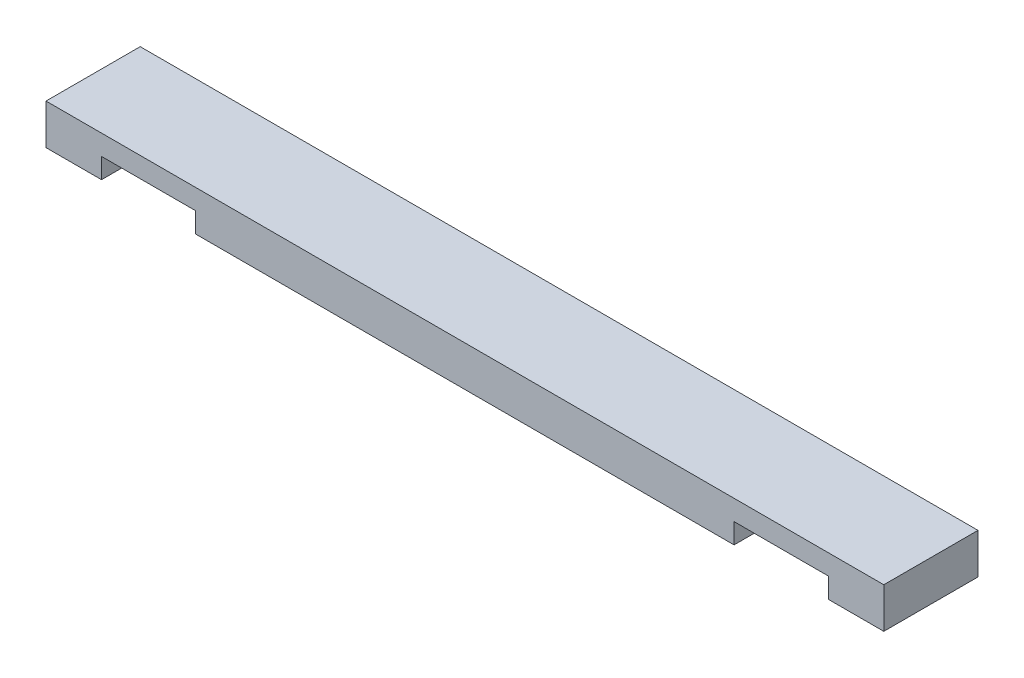
ISO-10303-21;
HEADER;
FILE_DESCRIPTION(('STEP AP214'),'2;1');
FILE_NAME('part.step','',(''),(''),'','','');
FILE_SCHEMA(('AUTOMOTIVE_DESIGN { 1 0 10303 214 1 1 1 1 }'));
ENDSEC;
DATA;
#1=APPLICATION_CONTEXT('core data for automotive mechanical design processes');
#2=APPLICATION_PROTOCOL_DEFINITION('international standard','automotive_design',2000,#1);
#3=PRODUCT_CONTEXT('',#1,'mechanical');
#4=PRODUCT('Part','Part','',(#3));
#5=PRODUCT_RELATED_PRODUCT_CATEGORY('part','',(#4));
#6=PRODUCT_DEFINITION_FORMATION('','',#4);
#7=PRODUCT_DEFINITION_CONTEXT('part definition',#1,'design');
#8=PRODUCT_DEFINITION('design','',#6,#7);
#9=PRODUCT_DEFINITION_SHAPE('','',#8);
#10=(LENGTH_UNIT() NAMED_UNIT(*) SI_UNIT(.MILLI.,.METRE.));
#11=(NAMED_UNIT(*) PLANE_ANGLE_UNIT() SI_UNIT($,.RADIAN.));
#12=(NAMED_UNIT(*) SI_UNIT($,.STERADIAN.) SOLID_ANGLE_UNIT());
#13=UNCERTAINTY_MEASURE_WITH_UNIT(LENGTH_MEASURE(1.E-05),#10,'distance_accuracy_value','');
#14=(GEOMETRIC_REPRESENTATION_CONTEXT(3) GLOBAL_UNCERTAINTY_ASSIGNED_CONTEXT((#13)) GLOBAL_UNIT_ASSIGNED_CONTEXT((#10,
#11,#12)) REPRESENTATION_CONTEXT('',''));
#15=CARTESIAN_POINT('',(0.,0.,0.));
#16=DIRECTION('',(0.,0.,1.));
#17=DIRECTION('',(1.,0.,0.));
#18=AXIS2_PLACEMENT_3D('',#15,#16,#17);
#19=CARTESIAN_POINT('',(0.,0.,0.));
#20=DIRECTION('',(0.,-1.,0.));
#21=DIRECTION('',(0.,0.,-1.));
#22=AXIS2_PLACEMENT_3D('',#19,#20,#21);
#23=PLANE('',#22);
#24=DIRECTION('',(0.,0.,1.));
#25=VECTOR('',#24,1.);
#26=CARTESIAN_POINT('',(738.187500000009,0.,-88.9));
#27=LINE('',#26,#25);
#28=CARTESIAN_POINT('',(738.187500000009,0.,-88.9));
#29=VERTEX_POINT('',#28);
#30=CARTESIAN_POINT('',(738.187500000009,0.,0.));
#31=VERTEX_POINT('',#30);
#32=EDGE_CURVE('E172',#29,#31,#27,.T.);
#33=ORIENTED_EDGE('',*,*,#32,.F.);
#34=DIRECTION('',(-1.,0.,0.));
#35=VECTOR('',#34,1.);
#36=CARTESIAN_POINT('',(0.,0.,-88.9));
#37=LINE('',#36,#35);
#38=CARTESIAN_POINT('',(790.575,0.,-88.9));
#39=VERTEX_POINT('',#38);
#40=EDGE_CURVE('E157',#39,#29,#37,.T.);
#41=ORIENTED_EDGE('',*,*,#40,.F.);
#42=DIRECTION('',(0.,0.,-1.));
#43=VECTOR('',#42,1.);
#44=CARTESIAN_POINT('',(790.575,0.,0.));
#45=LINE('',#44,#43);
#46=CARTESIAN_POINT('',(790.575,0.,0.));
#47=VERTEX_POINT('',#46);
#48=EDGE_CURVE('E236',#47,#39,#45,.T.);
#49=ORIENTED_EDGE('',*,*,#48,.F.);
#50=DIRECTION('',(1.,0.,0.));
#51=VECTOR('',#50,1.);
#52=CARTESIAN_POINT('',(0.,0.,0.));
#53=LINE('',#52,#51);
#54=EDGE_CURVE('E231',#31,#47,#53,.T.);
#55=ORIENTED_EDGE('',*,*,#54,.F.);
#56=EDGE_LOOP('',(#33,#41,#49,#55));
#57=FACE_BOUND('',#56,.T.);
#58=ADVANCED_FACE('F41',(#57),#23,.T.);
#59=DIRECTION('',(0.,0.,1.));
#60=VECTOR('',#59,1.);
#61=CARTESIAN_POINT('',(649.287500000009,0.,-88.9));
#62=LINE('',#61,#60);
#63=CARTESIAN_POINT('',(649.287500000009,0.,-88.9));
#64=VERTEX_POINT('',#63);
#65=CARTESIAN_POINT('',(649.287500000008,0.,0.));
#66=VERTEX_POINT('',#65);
#67=EDGE_CURVE('E176',#64,#66,#62,.T.);
#68=ORIENTED_EDGE('',*,*,#67,.T.);
#69=CARTESIAN_POINT('',(141.300199999996,0.,0.));
#70=VERTEX_POINT('',#69);
#71=EDGE_CURVE('E237',#70,#66,#53,.T.);
#72=ORIENTED_EDGE('',*,*,#71,.F.);
#73=DIRECTION('',(0.,0.,1.));
#74=VECTOR('',#73,1.);
#75=CARTESIAN_POINT('',(141.300199999996,0.,-88.9));
#76=LINE('',#75,#74);
#77=CARTESIAN_POINT('',(141.300199999996,0.,-88.9));
#78=VERTEX_POINT('',#77);
#79=EDGE_CURVE('E191',#78,#70,#76,.T.);
#80=ORIENTED_EDGE('',*,*,#79,.F.);
#81=EDGE_CURVE('E243',#64,#78,#37,.T.);
#82=ORIENTED_EDGE('',*,*,#81,.F.);
#83=EDGE_LOOP('',(#68,#72,#80,#82));
#84=FACE_BOUND('',#83,.T.);
#85=ADVANCED_FACE('F294',(#84),#23,.T.);
#86=CARTESIAN_POINT('',(0.,38.1,0.));
#87=DIRECTION('',(1.,0.,0.));
#88=DIRECTION('',(0.,0.,-1.));
#89=AXIS2_PLACEMENT_3D('',#86,#87,#88);
#90=PLANE('',#89);
#91=DIRECTION('',(0.,0.,1.));
#92=VECTOR('',#91,1.);
#93=CARTESIAN_POINT('',(0.,0.,0.));
#94=LINE('',#93,#92);
#95=CARTESIAN_POINT('',(0.,0.,-88.9));
#96=VERTEX_POINT('',#95);
#97=CARTESIAN_POINT('',(0.,0.,0.));
#98=VERTEX_POINT('',#97);
#99=EDGE_CURVE('E175',#96,#98,#94,.T.);
#100=ORIENTED_EDGE('',*,*,#99,.T.);
#101=DIRECTION('',(0.,-1.,0.));
#102=VECTOR('',#101,1.);
#103=CARTESIAN_POINT('',(0.,38.1,0.));
#104=LINE('',#103,#102);
#105=CARTESIAN_POINT('',(0.,38.1,0.));
#106=VERTEX_POINT('',#105);
#107=EDGE_CURVE('E11',#106,#98,#104,.T.);
#108=ORIENTED_EDGE('',*,*,#107,.F.);
#109=DIRECTION('',(0.,0.,1.));
#110=VECTOR('',#109,1.);
#111=CARTESIAN_POINT('',(0.,38.1,0.));
#112=LINE('',#111,#110);
#113=CARTESIAN_POINT('',(0.,38.1,-88.9));
#114=VERTEX_POINT('',#113);
#115=EDGE_CURVE('E214',#114,#106,#112,.T.);
#116=ORIENTED_EDGE('',*,*,#115,.F.);
#117=DIRECTION('',(0.,-1.,0.));
#118=VECTOR('',#117,1.);
#119=CARTESIAN_POINT('',(0.,38.1,-88.9));
#120=LINE('',#119,#118);
#121=EDGE_CURVE('E227',#114,#96,#120,.T.);
#122=ORIENTED_EDGE('',*,*,#121,.T.);
#123=EDGE_LOOP('',(#100,#108,#116,#122));
#124=FACE_BOUND('',#123,.T.);
#125=ADVANCED_FACE('F43',(#124),#90,.F.);
#126=CARTESIAN_POINT('',(0.,38.1,0.));
#127=DIRECTION('',(0.,0.,-1.));
#128=DIRECTION('',(-1.,0.,0.));
#129=AXIS2_PLACEMENT_3D('',#126,#127,#128);
#130=PLANE('',#129);
#131=DIRECTION('',(-1.,0.,0.));
#132=VECTOR('',#131,1.);
#133=CARTESIAN_POINT('',(738.187500000009,19.05,0.));
#134=LINE('',#133,#132);
#135=CARTESIAN_POINT('',(738.187500000009,19.05,0.));
#136=VERTEX_POINT('',#135);
#137=CARTESIAN_POINT('',(649.287500000009,19.05,0.));
#138=VERTEX_POINT('',#137);
#139=EDGE_CURVE('E162',#136,#138,#134,.T.);
#140=ORIENTED_EDGE('',*,*,#139,.F.);
#141=DIRECTION('',(0.,1.,0.));
#142=VECTOR('',#141,1.);
#143=CARTESIAN_POINT('',(738.187500000009,0.,0.));
#144=LINE('',#143,#142);
#145=EDGE_CURVE('E137',#31,#136,#144,.T.);
#146=ORIENTED_EDGE('',*,*,#145,.F.);
#147=ORIENTED_EDGE('',*,*,#54,.T.);
#148=DIRECTION('',(0.,-1.,0.));
#149=VECTOR('',#148,1.);
#150=CARTESIAN_POINT('',(790.575,38.1,0.));
#151=LINE('',#150,#149);
#152=CARTESIAN_POINT('',(790.575,38.1,0.));
#153=VERTEX_POINT('',#152);
#154=EDGE_CURVE('E50',#153,#47,#151,.T.);
#155=ORIENTED_EDGE('',*,*,#154,.F.);
#156=DIRECTION('',(1.,0.,0.));
#157=VECTOR('',#156,1.);
#158=CARTESIAN_POINT('',(0.,38.1,0.));
#159=LINE('',#158,#157);
#160=EDGE_CURVE('E218',#106,#153,#159,.T.);
#161=ORIENTED_EDGE('',*,*,#160,.F.);
#162=ORIENTED_EDGE('',*,*,#107,.T.);
#163=CARTESIAN_POINT('',(52.400199999996,0.,0.));
#164=VERTEX_POINT('',#163);
#165=EDGE_CURVE('E232',#98,#164,#53,.T.);
#166=ORIENTED_EDGE('',*,*,#165,.T.);
#167=DIRECTION('',(0.,-1.,0.));
#168=VECTOR('',#167,1.);
#169=CARTESIAN_POINT('',(52.400199999996,0.,0.));
#170=LINE('',#169,#168);
#171=CARTESIAN_POINT('',(52.400199999996,19.05,0.));
#172=VERTEX_POINT('',#171);
#173=EDGE_CURVE('E65',#172,#164,#170,.T.);
#174=ORIENTED_EDGE('',*,*,#173,.F.);
#175=DIRECTION('',(-1.,0.,0.));
#176=VECTOR('',#175,1.);
#177=CARTESIAN_POINT('',(141.300199999996,19.05,0.));
#178=LINE('',#177,#176);
#179=CARTESIAN_POINT('',(141.300199999996,19.05,0.));
#180=VERTEX_POINT('',#179);
#181=EDGE_CURVE('E196',#180,#172,#178,.T.);
#182=ORIENTED_EDGE('',*,*,#181,.F.);
#183=DIRECTION('',(0.,1.,0.));
#184=VECTOR('',#183,1.);
#185=CARTESIAN_POINT('',(141.300199999996,0.,0.));
#186=LINE('',#185,#184);
#187=EDGE_CURVE('E169',#70,#180,#186,.T.);
#188=ORIENTED_EDGE('',*,*,#187,.F.);
#189=ORIENTED_EDGE('',*,*,#71,.T.);
#190=DIRECTION('',(0.,-1.,0.));
#191=VECTOR('',#190,1.);
#192=CARTESIAN_POINT('',(649.287500000009,0.,0.));
#193=LINE('',#192,#191);
#194=EDGE_CURVE('E57',#138,#66,#193,.T.);
#195=ORIENTED_EDGE('',*,*,#194,.F.);
#196=EDGE_LOOP('',(#140,#146,#147,#155,#161,#162,#166,#174,#182,#188,#189,#195));
#197=FACE_BOUND('',#196,.T.);
#198=ADVANCED_FACE('F261',(#197),#130,.F.);
#199=CARTESIAN_POINT('',(790.575,38.1,0.));
#200=DIRECTION('',(-1.,0.,0.));
#201=DIRECTION('',(0.,0.,1.));
#202=AXIS2_PLACEMENT_3D('',#199,#200,#201);
#203=PLANE('',#202);
#204=ORIENTED_EDGE('',*,*,#48,.T.);
#205=DIRECTION('',(0.,-1.,0.));
#206=VECTOR('',#205,1.);
#207=CARTESIAN_POINT('',(790.575,38.1,-88.9));
#208=LINE('',#207,#206);
#209=CARTESIAN_POINT('',(790.575,38.1,-88.9));
#210=VERTEX_POINT('',#209);
#211=EDGE_CURVE('E247',#210,#39,#208,.T.);
#212=ORIENTED_EDGE('',*,*,#211,.F.);
#213=DIRECTION('',(0.,0.,-1.));
#214=VECTOR('',#213,1.);
#215=CARTESIAN_POINT('',(790.575,38.1,0.));
#216=LINE('',#215,#214);
#217=EDGE_CURVE('E221',#153,#210,#216,.T.);
#218=ORIENTED_EDGE('',*,*,#217,.F.);
#219=ORIENTED_EDGE('',*,*,#154,.T.);
#220=EDGE_LOOP('',(#204,#212,#218,#219));
#221=FACE_BOUND('',#220,.T.);
#222=ADVANCED_FACE('F256',(#221),#203,.F.);
#223=CARTESIAN_POINT('',(0.,38.1,-88.9));
#224=DIRECTION('',(0.,0.,1.));
#225=DIRECTION('',(1.,0.,0.));
#226=AXIS2_PLACEMENT_3D('',#223,#224,#225);
#227=PLANE('',#226);
#228=ORIENTED_EDGE('',*,*,#40,.T.);
#229=DIRECTION('',(0.,1.,0.));
#230=VECTOR('',#229,1.);
#231=CARTESIAN_POINT('',(738.187500000009,0.,-88.9));
#232=LINE('',#231,#230);
#233=CARTESIAN_POINT('',(738.187500000009,19.05,-88.9));
#234=VERTEX_POINT('',#233);
#235=EDGE_CURVE('E134',#29,#234,#232,.T.);
#236=ORIENTED_EDGE('',*,*,#235,.T.);
#237=DIRECTION('',(-1.,0.,0.));
#238=VECTOR('',#237,1.);
#239=CARTESIAN_POINT('',(738.187500000009,19.05,-88.9));
#240=LINE('',#239,#238);
#241=CARTESIAN_POINT('',(649.287500000009,19.05,-88.9));
#242=VERTEX_POINT('',#241);
#243=EDGE_CURVE('E146',#234,#242,#240,.T.);
#244=ORIENTED_EDGE('',*,*,#243,.T.);
#245=DIRECTION('',(0.,-1.,0.));
#246=VECTOR('',#245,1.);
#247=CARTESIAN_POINT('',(649.287500000009,0.,-88.9));
#248=LINE('',#247,#246);
#249=EDGE_CURVE('E143',#242,#64,#248,.T.);
#250=ORIENTED_EDGE('',*,*,#249,.T.);
#251=ORIENTED_EDGE('',*,*,#81,.T.);
#252=DIRECTION('',(0.,1.,0.));
#253=VECTOR('',#252,1.);
#254=CARTESIAN_POINT('',(141.300199999996,0.,-88.9));
#255=LINE('',#254,#253);
#256=CARTESIAN_POINT('',(141.300199999996,19.05,-88.9));
#257=VERTEX_POINT('',#256);
#258=EDGE_CURVE('E197',#78,#257,#255,.T.);
#259=ORIENTED_EDGE('',*,*,#258,.T.);
#260=DIRECTION('',(-1.,0.,0.));
#261=VECTOR('',#260,1.);
#262=CARTESIAN_POINT('',(141.300199999996,19.05,-88.9));
#263=LINE('',#262,#261);
#264=CARTESIAN_POINT('',(52.400199999996,19.05,-88.9));
#265=VERTEX_POINT('',#264);
#266=EDGE_CURVE('E207',#257,#265,#263,.T.);
#267=ORIENTED_EDGE('',*,*,#266,.T.);
#268=DIRECTION('',(0.,-1.,0.));
#269=VECTOR('',#268,1.);
#270=CARTESIAN_POINT('',(52.400199999996,0.,-88.9));
#271=LINE('',#270,#269);
#272=CARTESIAN_POINT('',(52.400199999996,0.,-88.9));
#273=VERTEX_POINT('',#272);
#274=EDGE_CURVE('E184',#265,#273,#271,.T.);
#275=ORIENTED_EDGE('',*,*,#274,.T.);
#276=EDGE_CURVE('E240',#273,#96,#37,.T.);
#277=ORIENTED_EDGE('',*,*,#276,.T.);
#278=ORIENTED_EDGE('',*,*,#121,.F.);
#279=DIRECTION('',(-1.,0.,0.));
#280=VECTOR('',#279,1.);
#281=CARTESIAN_POINT('',(0.,38.1,-88.9));
#282=LINE('',#281,#280);
#283=EDGE_CURVE('E224',#210,#114,#282,.T.);
#284=ORIENTED_EDGE('',*,*,#283,.F.);
#285=ORIENTED_EDGE('',*,*,#211,.T.);
#286=EDGE_LOOP('',(#228,#236,#244,#250,#251,#259,#267,#275,#277,#278,#284,#285));
#287=FACE_BOUND('',#286,.T.);
#288=ADVANCED_FACE('F154',(#287),#227,.F.);
#289=CARTESIAN_POINT('',(0.,38.1,0.));
#290=DIRECTION('',(0.,-1.,0.));
#291=DIRECTION('',(0.,0.,-1.));
#292=AXIS2_PLACEMENT_3D('',#289,#290,#291);
#293=PLANE('',#292);
#294=ORIENTED_EDGE('',*,*,#115,.T.);
#295=ORIENTED_EDGE('',*,*,#160,.T.);
#296=ORIENTED_EDGE('',*,*,#217,.T.);
#297=ORIENTED_EDGE('',*,*,#283,.T.);
#298=EDGE_LOOP('',(#294,#295,#296,#297));
#299=FACE_BOUND('',#298,.T.);
#300=ADVANCED_FACE('F311',(#299),#293,.F.);
#301=DIRECTION('',(0.,0.,1.));
#302=VECTOR('',#301,1.);
#303=CARTESIAN_POINT('',(52.400199999996,0.,-88.9));
#304=LINE('',#303,#302);
#305=EDGE_CURVE('E188',#273,#164,#304,.T.);
#306=ORIENTED_EDGE('',*,*,#305,.T.);
#307=ORIENTED_EDGE('',*,*,#165,.F.);
#308=ORIENTED_EDGE('',*,*,#99,.F.);
#309=ORIENTED_EDGE('',*,*,#276,.F.);
#310=EDGE_LOOP('',(#306,#307,#308,#309));
#311=FACE_BOUND('',#310,.T.);
#312=ADVANCED_FACE('F305',(#311),#23,.T.);
#313=CARTESIAN_POINT('',(141.300199999996,0.,-88.9));
#314=DIRECTION('',(1.,0.,0.));
#315=DIRECTION('',(0.,0.,-1.));
#316=AXIS2_PLACEMENT_3D('',#313,#314,#315);
#317=PLANE('',#316);
#318=ORIENTED_EDGE('',*,*,#187,.T.);
#319=DIRECTION('',(0.,0.,1.));
#320=VECTOR('',#319,1.);
#321=CARTESIAN_POINT('',(141.300199999996,19.05,-88.9));
#322=LINE('',#321,#320);
#323=EDGE_CURVE('E181',#257,#180,#322,.T.);
#324=ORIENTED_EDGE('',*,*,#323,.F.);
#325=ORIENTED_EDGE('',*,*,#258,.F.);
#326=ORIENTED_EDGE('',*,*,#79,.T.);
#327=EDGE_LOOP('',(#318,#324,#325,#326));
#328=FACE_BOUND('',#327,.T.);
#329=ADVANCED_FACE('F296',(#328),#317,.F.);
#330=CARTESIAN_POINT('',(52.400199999996,0.,-88.9));
#331=DIRECTION('',(-1.,0.,0.));
#332=DIRECTION('',(0.,0.,1.));
#333=AXIS2_PLACEMENT_3D('',#330,#331,#332);
#334=PLANE('',#333);
#335=ORIENTED_EDGE('',*,*,#173,.T.);
#336=ORIENTED_EDGE('',*,*,#305,.F.);
#337=ORIENTED_EDGE('',*,*,#274,.F.);
#338=DIRECTION('',(0.,0.,1.));
#339=VECTOR('',#338,1.);
#340=CARTESIAN_POINT('',(52.400199999996,19.05,-88.9));
#341=LINE('',#340,#339);
#342=EDGE_CURVE('E185',#265,#172,#341,.T.);
#343=ORIENTED_EDGE('',*,*,#342,.T.);
#344=EDGE_LOOP('',(#335,#336,#337,#343));
#345=FACE_BOUND('',#344,.T.);
#346=ADVANCED_FACE('F376',(#345),#334,.F.);
#347=CARTESIAN_POINT('',(141.300199999996,19.05,-88.9));
#348=DIRECTION('',(0.,1.,0.));
#349=DIRECTION('',(-1.,0.,0.));
#350=AXIS2_PLACEMENT_3D('',#347,#348,#349);
#351=PLANE('',#350);
#352=ORIENTED_EDGE('',*,*,#181,.T.);
#353=ORIENTED_EDGE('',*,*,#342,.F.);
#354=ORIENTED_EDGE('',*,*,#266,.F.);
#355=ORIENTED_EDGE('',*,*,#323,.T.);
#356=EDGE_LOOP('',(#352,#353,#354,#355));
#357=FACE_BOUND('',#356,.T.);
#358=ADVANCED_FACE('F299',(#357),#351,.F.);
#359=CARTESIAN_POINT('',(738.187500000009,0.,-88.9));
#360=DIRECTION('',(1.,0.,0.));
#361=DIRECTION('',(0.,0.,-1.));
#362=AXIS2_PLACEMENT_3D('',#359,#360,#361);
#363=PLANE('',#362);
#364=ORIENTED_EDGE('',*,*,#145,.T.);
#365=DIRECTION('',(0.,0.,1.));
#366=VECTOR('',#365,1.);
#367=CARTESIAN_POINT('',(738.187500000009,19.05,-88.9));
#368=LINE('',#367,#366);
#369=EDGE_CURVE('E130',#234,#136,#368,.T.);
#370=ORIENTED_EDGE('',*,*,#369,.F.);
#371=ORIENTED_EDGE('',*,*,#235,.F.);
#372=ORIENTED_EDGE('',*,*,#32,.T.);
#373=EDGE_LOOP('',(#364,#370,#371,#372));
#374=FACE_BOUND('',#373,.T.);
#375=ADVANCED_FACE('F132',(#374),#363,.F.);
#376=CARTESIAN_POINT('',(649.287500000009,0.,-88.9));
#377=DIRECTION('',(-1.,0.,0.));
#378=DIRECTION('',(0.,0.,1.));
#379=AXIS2_PLACEMENT_3D('',#376,#377,#378);
#380=PLANE('',#379);
#381=ORIENTED_EDGE('',*,*,#194,.T.);
#382=ORIENTED_EDGE('',*,*,#67,.F.);
#383=ORIENTED_EDGE('',*,*,#249,.F.);
#384=DIRECTION('',(0.,0.,1.));
#385=VECTOR('',#384,1.);
#386=CARTESIAN_POINT('',(649.287500000009,19.05,-88.9));
#387=LINE('',#386,#385);
#388=EDGE_CURVE('E142',#242,#138,#387,.T.);
#389=ORIENTED_EDGE('',*,*,#388,.T.);
#390=EDGE_LOOP('',(#381,#382,#383,#389));
#391=FACE_BOUND('',#390,.T.);
#392=ADVANCED_FACE('F400',(#391),#380,.F.);
#393=CARTESIAN_POINT('',(738.187500000009,19.05,-88.9));
#394=DIRECTION('',(0.,1.,0.));
#395=DIRECTION('',(-1.,0.,0.));
#396=AXIS2_PLACEMENT_3D('',#393,#394,#395);
#397=PLANE('',#396);
#398=ORIENTED_EDGE('',*,*,#139,.T.);
#399=ORIENTED_EDGE('',*,*,#388,.F.);
#400=ORIENTED_EDGE('',*,*,#243,.F.);
#401=ORIENTED_EDGE('',*,*,#369,.T.);
#402=EDGE_LOOP('',(#398,#399,#400,#401));
#403=FACE_BOUND('',#402,.T.);
#404=ADVANCED_FACE('F147',(#403),#397,.F.);
#405=CLOSED_SHELL('',(#58,#85,#125,#198,#222,#288,#300,#312,#329,#346,#358,#375,#392,#404));
#406=MANIFOLD_SOLID_BREP('B2',#405);
#407=ADVANCED_BREP_SHAPE_REPRESENTATION('',(#18,#406),#14);
#408=SHAPE_DEFINITION_REPRESENTATION(#9,#407);
ENDSEC;
END-ISO-10303-21;
